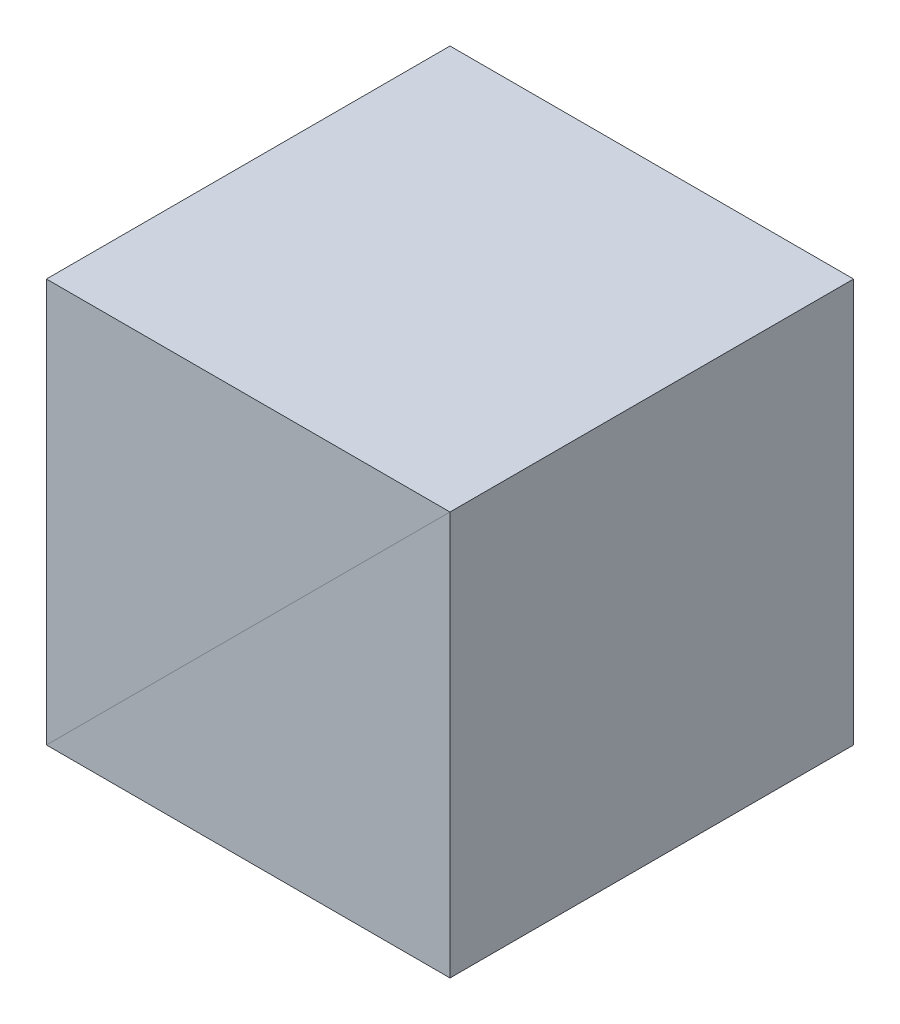
ISO-10303-21;
HEADER;
FILE_DESCRIPTION(('STEP AP214'),'2;1');
FILE_NAME('part.step','',(''),(''),'','','');
FILE_SCHEMA(('AUTOMOTIVE_DESIGN { 1 0 10303 214 1 1 1 1 }'));
ENDSEC;
DATA;
#1=APPLICATION_CONTEXT('core data for automotive mechanical design processes');
#2=APPLICATION_PROTOCOL_DEFINITION('international standard','automotive_design',2000,#1);
#3=PRODUCT_CONTEXT('',#1,'mechanical');
#4=PRODUCT('Part','Part','',(#3));
#5=PRODUCT_RELATED_PRODUCT_CATEGORY('part','',(#4));
#6=PRODUCT_DEFINITION_FORMATION('','',#4);
#7=PRODUCT_DEFINITION_CONTEXT('part definition',#1,'design');
#8=PRODUCT_DEFINITION('design','',#6,#7);
#9=PRODUCT_DEFINITION_SHAPE('','',#8);
#10=(LENGTH_UNIT() NAMED_UNIT(*) SI_UNIT(.MILLI.,.METRE.));
#11=(NAMED_UNIT(*) PLANE_ANGLE_UNIT() SI_UNIT($,.RADIAN.));
#12=(NAMED_UNIT(*) SI_UNIT($,.STERADIAN.) SOLID_ANGLE_UNIT());
#13=UNCERTAINTY_MEASURE_WITH_UNIT(LENGTH_MEASURE(1.E-05),#10,'distance_accuracy_value','');
#14=(GEOMETRIC_REPRESENTATION_CONTEXT(3) GLOBAL_UNCERTAINTY_ASSIGNED_CONTEXT((#13)) GLOBAL_UNIT_ASSIGNED_CONTEXT((#10,
#11,#12)) REPRESENTATION_CONTEXT('',''));
#15=CARTESIAN_POINT('',(0.,0.,0.));
#16=DIRECTION('',(0.,0.,1.));
#17=DIRECTION('',(1.,0.,0.));
#18=AXIS2_PLACEMENT_3D('',#15,#16,#17);
#19=CARTESIAN_POINT('',(5.,5.,5.));
#20=DIRECTION('',(-0.707106781186547,0.707106781186548,0.));
#21=DIRECTION('',(0.707106781186548,0.707106781186547,0.));
#22=AXIS2_PLACEMENT_3D('',#19,#20,#21);
#23=PLANE('',#22);
#24=DIRECTION('',(-0.707106781186548,-0.707106781186547,0.));
#25=VECTOR('',#24,1.);
#26=CARTESIAN_POINT('',(5.,5.,-5.));
#27=LINE('',#26,#25);
#28=CARTESIAN_POINT('',(5.,5.,-5.));
#29=VERTEX_POINT('',#28);
#30=CARTESIAN_POINT('',(-5.,-5.,-5.));
#31=VERTEX_POINT('',#30);
#32=EDGE_CURVE('E106',#29,#31,#27,.T.);
#33=ORIENTED_EDGE('',*,*,#32,.F.);
#34=DIRECTION('',(0.,0.,-1.));
#35=VECTOR('',#34,1.);
#36=CARTESIAN_POINT('',(5.,5.,5.));
#37=LINE('',#36,#35);
#38=CARTESIAN_POINT('',(5.,5.,5.));
#39=VERTEX_POINT('',#38);
#40=EDGE_CURVE('E98',#39,#29,#37,.T.);
#41=ORIENTED_EDGE('',*,*,#40,.F.);
#42=DIRECTION('',(-0.707106781186548,-0.707106781186547,0.));
#43=VECTOR('',#42,1.);
#44=CARTESIAN_POINT('',(5.,5.,5.));
#45=LINE('',#44,#43);
#46=CARTESIAN_POINT('',(-5.,-5.,5.));
#47=VERTEX_POINT('',#46);
#48=EDGE_CURVE('E89',#39,#47,#45,.T.);
#49=ORIENTED_EDGE('',*,*,#48,.T.);
#50=DIRECTION('',(0.,0.,-1.));
#51=VECTOR('',#50,1.);
#52=CARTESIAN_POINT('',(-5.,-5.,5.));
#53=LINE('',#52,#51);
#54=EDGE_CURVE('E12',#47,#31,#53,.T.);
#55=ORIENTED_EDGE('',*,*,#54,.T.);
#56=EDGE_LOOP('',(#33,#41,#49,#55));
#57=FACE_BOUND('',#56,.T.);
#58=ADVANCED_FACE('F49',(#57),#23,.F.);
#59=CARTESIAN_POINT('',(-5.,-5.,5.));
#60=DIRECTION('',(1.,0.,0.));
#61=DIRECTION('',(0.,0.,1.));
#62=AXIS2_PLACEMENT_3D('',#59,#60,#61);
#63=PLANE('',#62);
#64=DIRECTION('',(0.,1.,0.));
#65=VECTOR('',#64,1.);
#66=CARTESIAN_POINT('',(-5.,-5.,-5.));
#67=LINE('',#66,#65);
#68=CARTESIAN_POINT('',(-5.,5.,-5.));
#69=VERTEX_POINT('',#68);
#70=EDGE_CURVE('E95',#31,#69,#67,.T.);
#71=ORIENTED_EDGE('',*,*,#70,.F.);
#72=ORIENTED_EDGE('',*,*,#54,.F.);
#73=DIRECTION('',(0.,1.,0.));
#74=VECTOR('',#73,1.);
#75=CARTESIAN_POINT('',(-5.,-5.,5.));
#76=LINE('',#75,#74);
#77=CARTESIAN_POINT('',(-5.,5.,5.));
#78=VERTEX_POINT('',#77);
#79=EDGE_CURVE('E85',#47,#78,#76,.T.);
#80=ORIENTED_EDGE('',*,*,#79,.T.);
#81=DIRECTION('',(0.,0.,-1.));
#82=VECTOR('',#81,1.);
#83=CARTESIAN_POINT('',(-5.,5.,5.));
#84=LINE('',#83,#82);
#85=EDGE_CURVE('E58',#78,#69,#84,.T.);
#86=ORIENTED_EDGE('',*,*,#85,.T.);
#87=EDGE_LOOP('',(#71,#72,#80,#86));
#88=FACE_BOUND('',#87,.T.);
#89=ADVANCED_FACE('F94',(#88),#63,.F.);
#90=CARTESIAN_POINT('',(5.,5.,5.));
#91=DIRECTION('',(0.,-1.,0.));
#92=DIRECTION('',(-1.,0.,0.));
#93=AXIS2_PLACEMENT_3D('',#90,#91,#92);
#94=PLANE('',#93);
#95=DIRECTION('',(1.,0.,0.));
#96=VECTOR('',#95,1.);
#97=CARTESIAN_POINT('',(5.,5.,-5.));
#98=LINE('',#97,#96);
#99=EDGE_CURVE('E77',#69,#29,#98,.T.);
#100=ORIENTED_EDGE('',*,*,#99,.F.);
#101=ORIENTED_EDGE('',*,*,#85,.F.);
#102=DIRECTION('',(1.,0.,0.));
#103=VECTOR('',#102,1.);
#104=CARTESIAN_POINT('',(5.,5.,5.));
#105=LINE('',#104,#103);
#106=EDGE_CURVE('E66',#78,#39,#105,.T.);
#107=ORIENTED_EDGE('',*,*,#106,.T.);
#108=ORIENTED_EDGE('',*,*,#40,.T.);
#109=EDGE_LOOP('',(#100,#101,#107,#108));
#110=FACE_BOUND('',#109,.T.);
#111=ADVANCED_FACE('F119',(#110),#94,.F.);
#112=CARTESIAN_POINT('',(0.,0.,5.));
#113=DIRECTION('',(0.,0.,1.));
#114=DIRECTION('',(0.,1.,0.));
#115=AXIS2_PLACEMENT_3D('',#112,#113,#114);
#116=PLANE('',#115);
#117=ORIENTED_EDGE('',*,*,#48,.F.);
#118=ORIENTED_EDGE('',*,*,#106,.F.);
#119=ORIENTED_EDGE('',*,*,#79,.F.);
#120=EDGE_LOOP('',(#117,#118,#119));
#121=FACE_BOUND('',#120,.T.);
#122=ADVANCED_FACE('F87',(#121),#116,.T.);
#123=CARTESIAN_POINT('',(0.,0.,-5.));
#124=DIRECTION('',(0.,0.,1.));
#125=DIRECTION('',(0.,1.,0.));
#126=AXIS2_PLACEMENT_3D('',#123,#124,#125);
#127=PLANE('',#126);
#128=ORIENTED_EDGE('',*,*,#32,.T.);
#129=ORIENTED_EDGE('',*,*,#70,.T.);
#130=ORIENTED_EDGE('',*,*,#99,.T.);
#131=EDGE_LOOP('',(#128,#129,#130));
#132=FACE_BOUND('',#131,.T.);
#133=ADVANCED_FACE('F113',(#132),#127,.F.);
#134=CLOSED_SHELL('',(#58,#89,#111,#122,#133));
#135=MANIFOLD_SOLID_BREP('B2',#134);
#136=CARTESIAN_POINT('',(5.,5.,5.));
#137=DIRECTION('',(0.707106781186547,-0.707106781186548,0.));
#138=DIRECTION('',(0.707106781186548,0.707106781186547,0.));
#139=AXIS2_PLACEMENT_3D('',#136,#137,#138);
#140=PLANE('',#139);
#141=DIRECTION('',(-0.707106781186548,-0.707106781186547,0.));
#142=VECTOR('',#141,1.);
#143=CARTESIAN_POINT('',(5.,5.,-5.));
#144=LINE('',#143,#142);
#145=CARTESIAN_POINT('',(5.,5.,-5.));
#146=VERTEX_POINT('',#145);
#147=CARTESIAN_POINT('',(-5.,-5.,-5.));
#148=VERTEX_POINT('',#147);
#149=EDGE_CURVE('E203',#146,#148,#144,.T.);
#150=ORIENTED_EDGE('',*,*,#149,.T.);
#151=DIRECTION('',(0.,0.,-1.));
#152=VECTOR('',#151,1.);
#153=CARTESIAN_POINT('',(-5.,-5.,5.));
#154=LINE('',#153,#152);
#155=CARTESIAN_POINT('',(-5.,-5.,5.));
#156=VERTEX_POINT('',#155);
#157=EDGE_CURVE('E47',#156,#148,#154,.T.);
#158=ORIENTED_EDGE('',*,*,#157,.F.);
#159=DIRECTION('',(-0.707106781186548,-0.707106781186547,0.));
#160=VECTOR('',#159,1.);
#161=CARTESIAN_POINT('',(5.,5.,5.));
#162=LINE('',#161,#160);
#163=CARTESIAN_POINT('',(5.,5.,5.));
#164=VERTEX_POINT('',#163);
#165=EDGE_CURVE('E196',#164,#156,#162,.T.);
#166=ORIENTED_EDGE('',*,*,#165,.F.);
#167=DIRECTION('',(0.,0.,-1.));
#168=VECTOR('',#167,1.);
#169=CARTESIAN_POINT('',(5.,5.,5.));
#170=LINE('',#169,#168);
#171=EDGE_CURVE('E204',#164,#146,#170,.T.);
#172=ORIENTED_EDGE('',*,*,#171,.T.);
#173=EDGE_LOOP('',(#150,#158,#166,#172));
#174=FACE_BOUND('',#173,.T.);
#175=ADVANCED_FACE('F156',(#174),#140,.F.);
#176=CARTESIAN_POINT('',(-5.,-5.,5.));
#177=DIRECTION('',(0.,1.,0.));
#178=DIRECTION('',(0.,0.,1.));
#179=AXIS2_PLACEMENT_3D('',#176,#177,#178);
#180=PLANE('',#179);
#181=DIRECTION('',(1.,0.,0.));
#182=VECTOR('',#181,1.);
#183=CARTESIAN_POINT('',(-5.,-5.,-5.));
#184=LINE('',#183,#182);
#185=CARTESIAN_POINT('',(5.,-5.,-5.));
#186=VERTEX_POINT('',#185);
#187=EDGE_CURVE('E184',#148,#186,#184,.T.);
#188=ORIENTED_EDGE('',*,*,#187,.T.);
#189=DIRECTION('',(0.,0.,-1.));
#190=VECTOR('',#189,1.);
#191=CARTESIAN_POINT('',(5.,-5.,5.));
#192=LINE('',#191,#190);
#193=CARTESIAN_POINT('',(5.,-5.,5.));
#194=VERTEX_POINT('',#193);
#195=EDGE_CURVE('E164',#194,#186,#192,.T.);
#196=ORIENTED_EDGE('',*,*,#195,.F.);
#197=DIRECTION('',(1.,0.,0.));
#198=VECTOR('',#197,1.);
#199=CARTESIAN_POINT('',(-5.,-5.,5.));
#200=LINE('',#199,#198);
#201=EDGE_CURVE('E192',#156,#194,#200,.T.);
#202=ORIENTED_EDGE('',*,*,#201,.F.);
#203=ORIENTED_EDGE('',*,*,#157,.T.);
#204=EDGE_LOOP('',(#188,#196,#202,#203));
#205=FACE_BOUND('',#204,.T.);
#206=ADVANCED_FACE('F193',(#205),#180,.F.);
#207=CARTESIAN_POINT('',(5.,5.,5.));
#208=DIRECTION('',(-1.,0.,0.));
#209=DIRECTION('',(0.,-1.,0.));
#210=AXIS2_PLACEMENT_3D('',#207,#208,#209);
#211=PLANE('',#210);
#212=DIRECTION('',(0.,1.,0.));
#213=VECTOR('',#212,1.);
#214=CARTESIAN_POINT('',(5.,5.,-5.));
#215=LINE('',#214,#213);
#216=EDGE_CURVE('E189',#186,#146,#215,.T.);
#217=ORIENTED_EDGE('',*,*,#216,.T.);
#218=ORIENTED_EDGE('',*,*,#171,.F.);
#219=DIRECTION('',(0.,1.,0.));
#220=VECTOR('',#219,1.);
#221=CARTESIAN_POINT('',(5.,5.,5.));
#222=LINE('',#221,#220);
#223=EDGE_CURVE('E172',#194,#164,#222,.T.);
#224=ORIENTED_EDGE('',*,*,#223,.F.);
#225=ORIENTED_EDGE('',*,*,#195,.T.);
#226=EDGE_LOOP('',(#217,#218,#224,#225));
#227=FACE_BOUND('',#226,.T.);
#228=ADVANCED_FACE('F211',(#227),#211,.F.);
#229=CARTESIAN_POINT('',(0.,0.,5.));
#230=DIRECTION('',(0.,0.,1.));
#231=DIRECTION('',(1.,0.,0.));
#232=AXIS2_PLACEMENT_3D('',#229,#230,#231);
#233=PLANE('',#232);
#234=ORIENTED_EDGE('',*,*,#165,.T.);
#235=ORIENTED_EDGE('',*,*,#201,.T.);
#236=ORIENTED_EDGE('',*,*,#223,.T.);
#237=EDGE_LOOP('',(#234,#235,#236));
#238=FACE_BOUND('',#237,.T.);
#239=ADVANCED_FACE('F199',(#238),#233,.T.);
#240=CARTESIAN_POINT('',(0.,0.,-5.));
#241=DIRECTION('',(0.,0.,1.));
#242=DIRECTION('',(1.,0.,0.));
#243=AXIS2_PLACEMENT_3D('',#240,#241,#242);
#244=PLANE('',#243);
#245=ORIENTED_EDGE('',*,*,#149,.F.);
#246=ORIENTED_EDGE('',*,*,#216,.F.);
#247=ORIENTED_EDGE('',*,*,#187,.F.);
#248=EDGE_LOOP('',(#245,#246,#247));
#249=FACE_BOUND('',#248,.T.);
#250=ADVANCED_FACE('F212',(#249),#244,.F.);
#251=CLOSED_SHELL('',(#175,#206,#228,#239,#250));
#252=MANIFOLD_SOLID_BREP('B6',#251);
#253=ADVANCED_BREP_SHAPE_REPRESENTATION('',(#18,#135,#252),#14);
#254=SHAPE_DEFINITION_REPRESENTATION(#9,#253);
ENDSEC;
END-ISO-10303-21;
